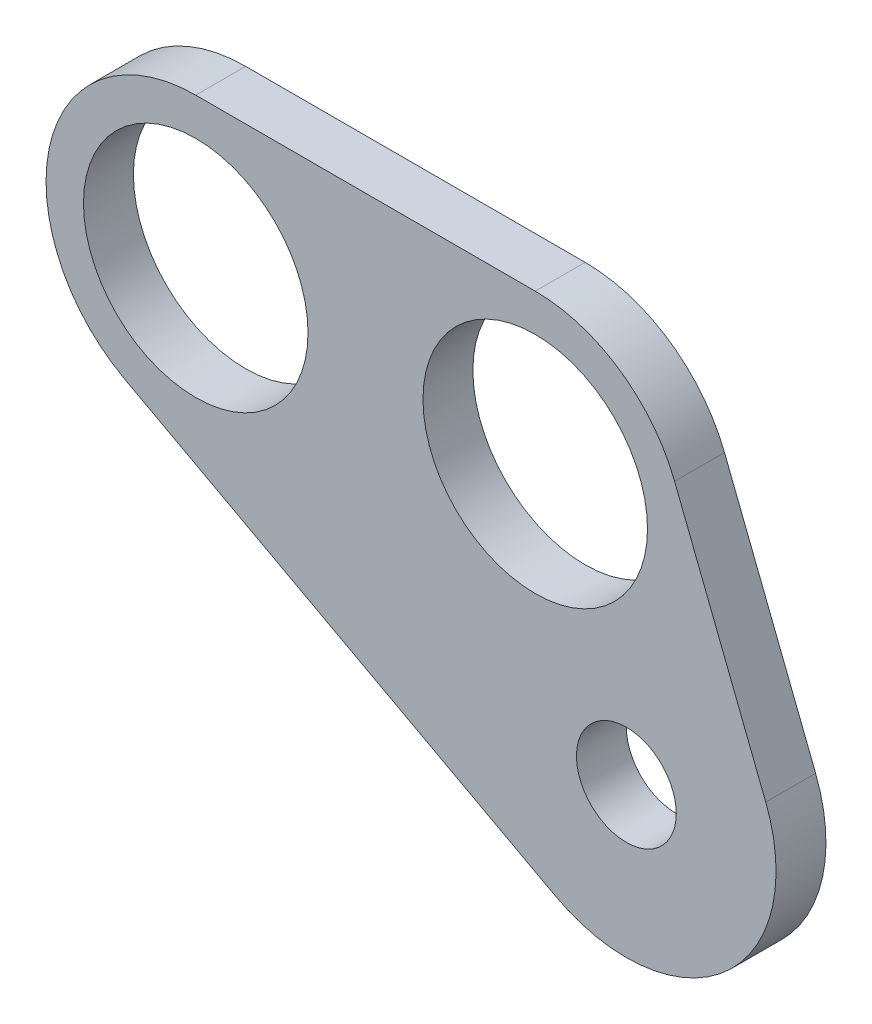
ISO-10303-21;
HEADER;
FILE_DESCRIPTION(('STEP AP214'),'2;1');
FILE_NAME('part.step','',(''),(''),'','','');
FILE_SCHEMA(('AUTOMOTIVE_DESIGN { 1 0 10303 214 1 1 1 1 }'));
ENDSEC;
DATA;
#1=APPLICATION_CONTEXT('core data for automotive mechanical design processes');
#2=APPLICATION_PROTOCOL_DEFINITION('international standard','automotive_design',2000,#1);
#3=PRODUCT_CONTEXT('',#1,'mechanical');
#4=PRODUCT('Part','Part','',(#3));
#5=PRODUCT_RELATED_PRODUCT_CATEGORY('part','',(#4));
#6=PRODUCT_DEFINITION_FORMATION('','',#4);
#7=PRODUCT_DEFINITION_CONTEXT('part definition',#1,'design');
#8=PRODUCT_DEFINITION('design','',#6,#7);
#9=PRODUCT_DEFINITION_SHAPE('','',#8);
#10=(LENGTH_UNIT() NAMED_UNIT(*) SI_UNIT(.MILLI.,.METRE.));
#11=(NAMED_UNIT(*) PLANE_ANGLE_UNIT() SI_UNIT($,.RADIAN.));
#12=(NAMED_UNIT(*) SI_UNIT($,.STERADIAN.) SOLID_ANGLE_UNIT());
#13=UNCERTAINTY_MEASURE_WITH_UNIT(LENGTH_MEASURE(1.E-05),#10,'distance_accuracy_value','');
#14=(GEOMETRIC_REPRESENTATION_CONTEXT(3) GLOBAL_UNCERTAINTY_ASSIGNED_CONTEXT((#13)) GLOBAL_UNIT_ASSIGNED_CONTEXT((#10,
#11,#12)) REPRESENTATION_CONTEXT('',''));
#15=CARTESIAN_POINT('',(0.,0.,0.));
#16=DIRECTION('',(0.,0.,1.));
#17=DIRECTION('',(1.,0.,0.));
#18=AXIS2_PLACEMENT_3D('',#15,#16,#17);
#19=CARTESIAN_POINT('',(0.,0.,6.35));
#20=DIRECTION('',(0.,0.,-1.));
#21=DIRECTION('',(-1.,0.,0.));
#22=AXIS2_PLACEMENT_3D('',#19,#20,#21);
#23=CYLINDRICAL_SURFACE('',#22,19.05);
#24=CARTESIAN_POINT('',(0.,0.,0.));
#25=DIRECTION('',(0.,0.,1.));
#26=DIRECTION('',(-1.,0.,0.));
#27=AXIS2_PLACEMENT_3D('',#24,#25,#26);
#28=CIRCLE('',#27,19.05);
#29=CARTESIAN_POINT('',(-9.04275809432158,-16.7669623381095,0.));
#30=VERTEX_POINT('',#29);
#31=CARTESIAN_POINT('',(17.7336955139867,6.95834343915342,0.));
#32=VERTEX_POINT('',#31);
#33=EDGE_CURVE('E118',#30,#32,#28,.T.);
#34=ORIENTED_EDGE('',*,*,#33,.T.);
#35=DIRECTION('',(0.,0.,-1.));
#36=VECTOR('',#35,1.);
#37=CARTESIAN_POINT('',(17.7336955139867,6.95834343915342,6.35));
#38=LINE('',#37,#36);
#39=CARTESIAN_POINT('',(17.7336955139867,6.95834343915342,6.35));
#40=VERTEX_POINT('',#39);
#41=EDGE_CURVE('E11',#40,#32,#38,.T.);
#42=ORIENTED_EDGE('',*,*,#41,.F.);
#43=CARTESIAN_POINT('',(0.,0.,6.35));
#44=DIRECTION('',(0.,0.,1.));
#45=DIRECTION('',(-1.,0.,0.));
#46=AXIS2_PLACEMENT_3D('',#43,#44,#45);
#47=CIRCLE('',#46,19.05);
#48=CARTESIAN_POINT('',(-9.04275809432158,-16.7669623381095,6.35));
#49=VERTEX_POINT('',#48);
#50=EDGE_CURVE('E129',#49,#40,#47,.T.);
#51=ORIENTED_EDGE('',*,*,#50,.F.);
#52=DIRECTION('',(0.,0.,-1.));
#53=VECTOR('',#52,1.);
#54=CARTESIAN_POINT('',(-9.04275809432158,-16.7669623381095,6.35));
#55=LINE('',#54,#53);
#56=EDGE_CURVE('E114',#49,#30,#55,.T.);
#57=ORIENTED_EDGE('',*,*,#56,.T.);
#58=EDGE_LOOP('',(#34,#42,#51,#57));
#59=FACE_BOUND('',#58,.T.);
#60=ADVANCED_FACE('F33',(#59),#23,.T.);
#61=CARTESIAN_POINT('',(6.13645644873097,36.5145026291312,6.35));
#62=DIRECTION('',(-0.930902651652843,-0.365267372134038,0.));
#63=DIRECTION('',(0.365267372134038,-0.930902651652843,0.));
#64=AXIS2_PLACEMENT_3D('',#61,#62,#63);
#65=PLANE('',#64);
#66=DIRECTION('',(-0.365267372134038,0.930902651652843,0.));
#67=VECTOR('',#66,1.);
#68=CARTESIAN_POINT('',(6.13645644873097,36.5145026291312,0.));
#69=LINE('',#68,#67);
#70=CARTESIAN_POINT('',(6.13645644873097,36.5145026291312,0.));
#71=VERTEX_POINT('',#70);
#72=EDGE_CURVE('E121',#32,#71,#69,.T.);
#73=ORIENTED_EDGE('',*,*,#72,.T.);
#74=DIRECTION('',(0.,0.,-1.));
#75=VECTOR('',#74,1.);
#76=CARTESIAN_POINT('',(6.13645644873097,36.5145026291312,6.35));
#77=LINE('',#76,#75);
#78=CARTESIAN_POINT('',(6.13645644873097,36.5145026291312,6.35));
#79=VERTEX_POINT('',#78);
#80=EDGE_CURVE('E42',#79,#71,#77,.T.);
#81=ORIENTED_EDGE('',*,*,#80,.F.);
#82=DIRECTION('',(-0.365267372134038,0.930902651652843,0.));
#83=VECTOR('',#82,1.);
#84=CARTESIAN_POINT('',(6.13645644873097,36.5145026291312,6.35));
#85=LINE('',#84,#83);
#86=EDGE_CURVE('E87',#40,#79,#85,.T.);
#87=ORIENTED_EDGE('',*,*,#86,.F.);
#88=ORIENTED_EDGE('',*,*,#41,.T.);
#89=EDGE_LOOP('',(#73,#81,#87,#88));
#90=FACE_BOUND('',#89,.T.);
#91=ADVANCED_FACE('F155',(#90),#65,.F.);
#92=CARTESIAN_POINT('',(-11.5972390652557,29.5561591899778,6.35));
#93=DIRECTION('',(0.,0.,-1.));
#94=DIRECTION('',(-1.,0.,0.));
#95=AXIS2_PLACEMENT_3D('',#92,#93,#94);
#96=CYLINDRICAL_SURFACE('',#95,19.05);
#97=CARTESIAN_POINT('',(-11.5972390652557,29.5561591899778,0.));
#98=DIRECTION('',(0.,0.,1.));
#99=DIRECTION('',(-1.,0.,0.));
#100=AXIS2_PLACEMENT_3D('',#97,#98,#99);
#101=CIRCLE('',#100,19.05);
#102=CARTESIAN_POINT('',(-11.5972390652557,48.6061591899778,0.));
#103=VERTEX_POINT('',#102);
#104=EDGE_CURVE('E124',#71,#103,#101,.T.);
#105=ORIENTED_EDGE('',*,*,#104,.T.);
#106=DIRECTION('',(0.,0.,-1.));
#107=VECTOR('',#106,1.);
#108=CARTESIAN_POINT('',(-11.5972390652557,48.6061591899778,6.35));
#109=LINE('',#108,#107);
#110=CARTESIAN_POINT('',(-11.5972390652557,48.6061591899778,6.35));
#111=VERTEX_POINT('',#110);
#112=EDGE_CURVE('E109',#111,#103,#109,.T.);
#113=ORIENTED_EDGE('',*,*,#112,.F.);
#114=CARTESIAN_POINT('',(-11.5972390652557,29.5561591899778,6.35));
#115=DIRECTION('',(0.,0.,1.));
#116=DIRECTION('',(-1.,0.,0.));
#117=AXIS2_PLACEMENT_3D('',#114,#115,#116);
#118=CIRCLE('',#117,19.05);
#119=EDGE_CURVE('E100',#79,#111,#118,.T.);
#120=ORIENTED_EDGE('',*,*,#119,.F.);
#121=ORIENTED_EDGE('',*,*,#80,.T.);
#122=EDGE_LOOP('',(#105,#113,#120,#121));
#123=FACE_BOUND('',#122,.T.);
#124=ADVANCED_FACE('F136',(#123),#96,.T.);
#125=CARTESIAN_POINT('',(-54.8026390652557,48.6061591899778,6.35));
#126=DIRECTION('',(0.,-1.,0.));
#127=DIRECTION('',(1.,0.,0.));
#128=AXIS2_PLACEMENT_3D('',#125,#126,#127);
#129=PLANE('',#128);
#130=DIRECTION('',(-1.,0.,0.));
#131=VECTOR('',#130,1.);
#132=CARTESIAN_POINT('',(-54.8026390652557,48.6061591899778,0.));
#133=LINE('',#132,#131);
#134=CARTESIAN_POINT('',(-54.8026390652557,48.6061591899778,0.));
#135=VERTEX_POINT('',#134);
#136=EDGE_CURVE('E108',#103,#135,#133,.T.);
#137=ORIENTED_EDGE('',*,*,#136,.T.);
#138=DIRECTION('',(0.,0.,-1.));
#139=VECTOR('',#138,1.);
#140=CARTESIAN_POINT('',(-54.8026390652557,48.6061591899778,6.35));
#141=LINE('',#140,#139);
#142=CARTESIAN_POINT('',(-54.8026390652557,48.6061591899778,6.35));
#143=VERTEX_POINT('',#142);
#144=EDGE_CURVE('E105',#143,#135,#141,.T.);
#145=ORIENTED_EDGE('',*,*,#144,.F.);
#146=DIRECTION('',(-1.,0.,0.));
#147=VECTOR('',#146,1.);
#148=CARTESIAN_POINT('',(-54.8026390652557,48.6061591899778,6.35));
#149=LINE('',#148,#147);
#150=EDGE_CURVE('E94',#111,#143,#149,.T.);
#151=ORIENTED_EDGE('',*,*,#150,.F.);
#152=ORIENTED_EDGE('',*,*,#112,.T.);
#153=EDGE_LOOP('',(#137,#145,#151,#152));
#154=FACE_BOUND('',#153,.T.);
#155=ADVANCED_FACE('F106',(#154),#129,.F.);
#156=CARTESIAN_POINT('',(-54.8026390652557,29.5561591899778,6.35));
#157=DIRECTION('',(0.,0.,-1.));
#158=DIRECTION('',(-1.,0.,0.));
#159=AXIS2_PLACEMENT_3D('',#156,#157,#158);
#160=CYLINDRICAL_SURFACE('',#159,19.05);
#161=CARTESIAN_POINT('',(-54.8026390652557,29.5561591899778,0.));
#162=DIRECTION('',(0.,0.,1.));
#163=DIRECTION('',(1.,0.,0.));
#164=AXIS2_PLACEMENT_3D('',#161,#162,#163);
#165=CIRCLE('',#164,19.05);
#166=CARTESIAN_POINT('',(-63.8453971595773,12.7891968518683,0.));
#167=VERTEX_POINT('',#166);
#168=EDGE_CURVE('E73',#135,#167,#165,.T.);
#169=ORIENTED_EDGE('',*,*,#168,.T.);
#170=DIRECTION('',(0.,0.,-1.));
#171=VECTOR('',#170,1.);
#172=CARTESIAN_POINT('',(-63.8453971595773,12.7891968518683,6.35));
#173=LINE('',#172,#171);
#174=CARTESIAN_POINT('',(-63.8453971595773,12.7891968518683,6.35));
#175=VERTEX_POINT('',#174);
#176=EDGE_CURVE('E110',#175,#167,#173,.T.);
#177=ORIENTED_EDGE('',*,*,#176,.F.);
#178=CARTESIAN_POINT('',(-54.8026390652557,29.5561591899778,6.35));
#179=DIRECTION('',(0.,0.,1.));
#180=DIRECTION('',(1.,0.,0.));
#181=AXIS2_PLACEMENT_3D('',#178,#179,#180);
#182=CIRCLE('',#181,19.05);
#183=EDGE_CURVE('E98',#143,#175,#182,.T.);
#184=ORIENTED_EDGE('',*,*,#183,.F.);
#185=ORIENTED_EDGE('',*,*,#144,.T.);
#186=EDGE_LOOP('',(#169,#177,#184,#185));
#187=FACE_BOUND('',#186,.T.);
#188=ADVANCED_FACE('F112',(#187),#160,.T.);
#189=CARTESIAN_POINT('',(-9.04275809432158,-16.7669623381095,6.35));
#190=DIRECTION('',(0.47468546426885,0.880155503312833,0.));
#191=DIRECTION('',(-0.880155503312833,0.47468546426885,0.));
#192=AXIS2_PLACEMENT_3D('',#189,#190,#191);
#193=PLANE('',#192);
#194=DIRECTION('',(0.880155503312833,-0.47468546426885,0.));
#195=VECTOR('',#194,1.);
#196=CARTESIAN_POINT('',(-9.04275809432158,-16.7669623381095,0.));
#197=LINE('',#196,#195);
#198=EDGE_CURVE('E79',#167,#30,#197,.T.);
#199=ORIENTED_EDGE('',*,*,#198,.T.);
#200=ORIENTED_EDGE('',*,*,#56,.F.);
#201=DIRECTION('',(0.880155503312833,-0.47468546426885,0.));
#202=VECTOR('',#201,1.);
#203=CARTESIAN_POINT('',(-9.04275809432158,-16.7669623381095,6.35));
#204=LINE('',#203,#202);
#205=EDGE_CURVE('E50',#175,#49,#204,.T.);
#206=ORIENTED_EDGE('',*,*,#205,.F.);
#207=ORIENTED_EDGE('',*,*,#176,.T.);
#208=EDGE_LOOP('',(#199,#200,#206,#207));
#209=FACE_BOUND('',#208,.T.);
#210=ADVANCED_FACE('F143',(#209),#193,.F.);
#211=CARTESIAN_POINT('',(0.,0.,6.35));
#212=DIRECTION('',(0.,0.,-1.));
#213=DIRECTION('',(-1.,0.,0.));
#214=AXIS2_PLACEMENT_3D('',#211,#212,#213);
#215=PLANE('',#214);
#216=CARTESIAN_POINT('',(0.,0.,6.35));
#217=DIRECTION('',(0.,0.,1.));
#218=DIRECTION('',(1.,0.,0.));
#219=AXIS2_PLACEMENT_3D('',#216,#217,#218);
#220=CIRCLE('',#219,6.35);
#221=CARTESIAN_POINT('',(6.35,0.,6.35));
#222=VERTEX_POINT('',#221);
#223=EDGE_CURVE('E230',#222,#222,#220,.T.);
#224=ORIENTED_EDGE('',*,*,#223,.F.);
#225=EDGE_LOOP('',(#224));
#226=FACE_BOUND('',#225,.T.);
#227=CARTESIAN_POINT('',(-54.8026390652557,29.5561591899778,6.35));
#228=DIRECTION('',(0.,0.,1.));
#229=DIRECTION('',(1.,0.,0.));
#230=AXIS2_PLACEMENT_3D('',#227,#228,#229);
#231=CIRCLE('',#230,14.2875);
#232=CARTESIAN_POINT('',(-40.5151390652557,29.5561591899778,6.35));
#233=VERTEX_POINT('',#232);
#234=EDGE_CURVE('E232',#233,#233,#231,.T.);
#235=ORIENTED_EDGE('',*,*,#234,.F.);
#236=EDGE_LOOP('',(#235));
#237=FACE_BOUND('',#236,.T.);
#238=CARTESIAN_POINT('',(-11.5972390652557,29.5561591899778,6.35));
#239=DIRECTION('',(0.,0.,1.));
#240=DIRECTION('',(1.,0.,0.));
#241=AXIS2_PLACEMENT_3D('',#238,#239,#240);
#242=CIRCLE('',#241,14.2875);
#243=CARTESIAN_POINT('',(2.6902609347443,29.5561591899778,6.35));
#244=VERTEX_POINT('',#243);
#245=EDGE_CURVE('E239',#244,#244,#242,.T.);
#246=ORIENTED_EDGE('',*,*,#245,.F.);
#247=EDGE_LOOP('',(#246));
#248=FACE_BOUND('',#247,.T.);
#249=ORIENTED_EDGE('',*,*,#50,.T.);
#250=ORIENTED_EDGE('',*,*,#86,.T.);
#251=ORIENTED_EDGE('',*,*,#119,.T.);
#252=ORIENTED_EDGE('',*,*,#150,.T.);
#253=ORIENTED_EDGE('',*,*,#183,.T.);
#254=ORIENTED_EDGE('',*,*,#205,.T.);
#255=EDGE_LOOP('',(#249,#250,#251,#252,#253,#254));
#256=FACE_BOUND('',#255,.T.);
#257=ADVANCED_FACE('F96',(#226,#237,#248,#256),#215,.F.);
#258=CARTESIAN_POINT('',(0.,0.,0.));
#259=DIRECTION('',(0.,0.,-1.));
#260=DIRECTION('',(-1.,0.,0.));
#261=AXIS2_PLACEMENT_3D('',#258,#259,#260);
#262=PLANE('',#261);
#263=CARTESIAN_POINT('',(0.,0.,0.));
#264=DIRECTION('',(0.,0.,-1.));
#265=DIRECTION('',(-1.,0.,0.));
#266=AXIS2_PLACEMENT_3D('',#263,#264,#265);
#267=CIRCLE('',#266,6.35);
#268=CARTESIAN_POINT('',(-6.35,0.,0.));
#269=VERTEX_POINT('',#268);
#270=EDGE_CURVE('E36',#269,#269,#267,.T.);
#271=ORIENTED_EDGE('',*,*,#270,.F.);
#272=EDGE_LOOP('',(#271));
#273=FACE_BOUND('',#272,.T.);
#274=CARTESIAN_POINT('',(-54.8026390652557,29.5561591899778,0.));
#275=DIRECTION('',(0.,0.,-1.));
#276=DIRECTION('',(-1.,0.,0.));
#277=AXIS2_PLACEMENT_3D('',#274,#275,#276);
#278=CIRCLE('',#277,14.2875);
#279=CARTESIAN_POINT('',(-69.0901390652557,29.5561591899778,0.));
#280=VERTEX_POINT('',#279);
#281=EDGE_CURVE('E236',#280,#280,#278,.T.);
#282=ORIENTED_EDGE('',*,*,#281,.F.);
#283=EDGE_LOOP('',(#282));
#284=FACE_BOUND('',#283,.T.);
#285=CARTESIAN_POINT('',(-11.5972390652557,29.5561591899778,0.));
#286=DIRECTION('',(0.,0.,-1.));
#287=DIRECTION('',(-1.,0.,0.));
#288=AXIS2_PLACEMENT_3D('',#285,#286,#287);
#289=CIRCLE('',#288,14.2875);
#290=CARTESIAN_POINT('',(-25.8847390652557,29.5561591899778,0.));
#291=VERTEX_POINT('',#290);
#292=EDGE_CURVE('E122',#291,#291,#289,.T.);
#293=ORIENTED_EDGE('',*,*,#292,.F.);
#294=EDGE_LOOP('',(#293));
#295=FACE_BOUND('',#294,.T.);
#296=ORIENTED_EDGE('',*,*,#33,.F.);
#297=ORIENTED_EDGE('',*,*,#198,.F.);
#298=ORIENTED_EDGE('',*,*,#168,.F.);
#299=ORIENTED_EDGE('',*,*,#136,.F.);
#300=ORIENTED_EDGE('',*,*,#104,.F.);
#301=ORIENTED_EDGE('',*,*,#72,.F.);
#302=EDGE_LOOP('',(#296,#297,#298,#299,#300,#301));
#303=FACE_BOUND('',#302,.T.);
#304=ADVANCED_FACE('F139',(#273,#284,#295,#303),#262,.T.);
#305=CARTESIAN_POINT('',(-11.5972390652557,29.5561591899778,6.35));
#306=DIRECTION('',(0.,0.,1.));
#307=DIRECTION('',(1.,0.,0.));
#308=AXIS2_PLACEMENT_3D('',#305,#306,#307);
#309=CYLINDRICAL_SURFACE('',#308,14.2875);
#310=ORIENTED_EDGE('',*,*,#292,.T.);
#311=EDGE_LOOP('',(#310));
#312=FACE_BOUND('',#311,.T.);
#313=ORIENTED_EDGE('',*,*,#245,.T.);
#314=EDGE_LOOP('',(#313));
#315=FACE_BOUND('',#314,.T.);
#316=ADVANCED_FACE('F183',(#312,#315),#309,.F.);
#317=CARTESIAN_POINT('',(-54.8026390652557,29.5561591899778,6.35));
#318=DIRECTION('',(0.,0.,1.));
#319=DIRECTION('',(1.,0.,0.));
#320=AXIS2_PLACEMENT_3D('',#317,#318,#319);
#321=CYLINDRICAL_SURFACE('',#320,14.2875);
#322=ORIENTED_EDGE('',*,*,#281,.T.);
#323=EDGE_LOOP('',(#322));
#324=FACE_BOUND('',#323,.T.);
#325=ORIENTED_EDGE('',*,*,#234,.T.);
#326=EDGE_LOOP('',(#325));
#327=FACE_BOUND('',#326,.T.);
#328=ADVANCED_FACE('F188',(#324,#327),#321,.F.);
#329=CARTESIAN_POINT('',(0.,0.,6.35));
#330=DIRECTION('',(0.,0.,1.));
#331=DIRECTION('',(1.,0.,0.));
#332=AXIS2_PLACEMENT_3D('',#329,#330,#331);
#333=CYLINDRICAL_SURFACE('',#332,6.35);
#334=ORIENTED_EDGE('',*,*,#270,.T.);
#335=EDGE_LOOP('',(#334));
#336=FACE_BOUND('',#335,.T.);
#337=ORIENTED_EDGE('',*,*,#223,.T.);
#338=EDGE_LOOP('',(#337));
#339=FACE_BOUND('',#338,.T.);
#340=ADVANCED_FACE('F200',(#336,#339),#333,.F.);
#341=CLOSED_SHELL('',(#60,#91,#124,#155,#188,#210,#257,#304,#316,#328,#340));
#342=MANIFOLD_SOLID_BREP('B2',#341);
#343=ADVANCED_BREP_SHAPE_REPRESENTATION('',(#18,#342),#14);
#344=SHAPE_DEFINITION_REPRESENTATION(#9,#343);
ENDSEC;
END-ISO-10303-21;
